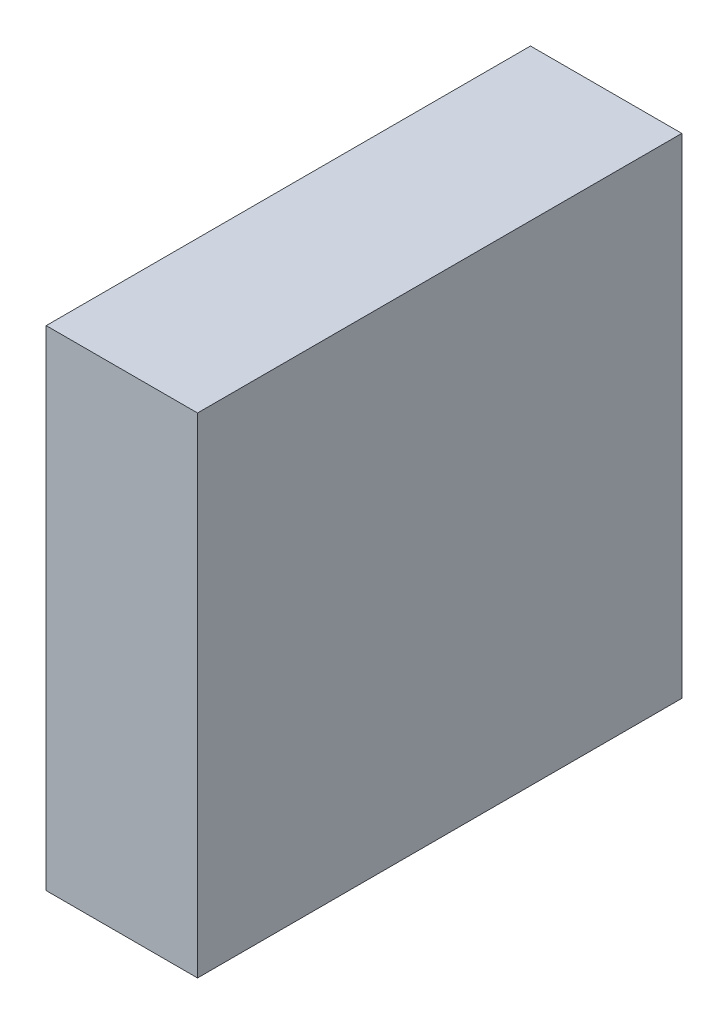
ISO-10303-21;
HEADER;
FILE_DESCRIPTION(('STEP AP214'),'2;1');
FILE_NAME('part.step','',(''),(''),'','','');
FILE_SCHEMA(('AUTOMOTIVE_DESIGN { 1 0 10303 214 1 1 1 1 }'));
ENDSEC;
DATA;
#1=APPLICATION_CONTEXT('core data for automotive mechanical design processes');
#2=APPLICATION_PROTOCOL_DEFINITION('international standard','automotive_design',2000,#1);
#3=PRODUCT_CONTEXT('',#1,'mechanical');
#4=PRODUCT('Part','Part','',(#3));
#5=PRODUCT_RELATED_PRODUCT_CATEGORY('part','',(#4));
#6=PRODUCT_DEFINITION_FORMATION('','',#4);
#7=PRODUCT_DEFINITION_CONTEXT('part definition',#1,'design');
#8=PRODUCT_DEFINITION('design','',#6,#7);
#9=PRODUCT_DEFINITION_SHAPE('','',#8);
#10=(LENGTH_UNIT() NAMED_UNIT(*) SI_UNIT(.MILLI.,.METRE.));
#11=(NAMED_UNIT(*) PLANE_ANGLE_UNIT() SI_UNIT($,.RADIAN.));
#12=(NAMED_UNIT(*) SI_UNIT($,.STERADIAN.) SOLID_ANGLE_UNIT());
#13=UNCERTAINTY_MEASURE_WITH_UNIT(LENGTH_MEASURE(1.E-05),#10,'distance_accuracy_value','');
#14=(GEOMETRIC_REPRESENTATION_CONTEXT(3) GLOBAL_UNCERTAINTY_ASSIGNED_CONTEXT((#13)) GLOBAL_UNIT_ASSIGNED_CONTEXT((#10,
#11,#12)) REPRESENTATION_CONTEXT('',''));
#15=CARTESIAN_POINT('',(0.,0.,0.));
#16=DIRECTION('',(0.,0.,1.));
#17=DIRECTION('',(1.,0.,0.));
#18=AXIS2_PLACEMENT_3D('',#15,#16,#17);
#19=CARTESIAN_POINT('',(30.,-48.5,-48.));
#20=DIRECTION('',(0.,0.,1.));
#21=DIRECTION('',(1.,0.,0.));
#22=AXIS2_PLACEMENT_3D('',#19,#20,#21);
#23=PLANE('',#22);
#24=DIRECTION('',(0.,1.,0.));
#25=VECTOR('',#24,1.);
#26=CARTESIAN_POINT('',(0.,-48.5,-48.));
#27=LINE('',#26,#25);
#28=CARTESIAN_POINT('',(0.,-48.5,-48.));
#29=VERTEX_POINT('',#28);
#30=CARTESIAN_POINT('',(0.,48.5,-48.));
#31=VERTEX_POINT('',#30);
#32=EDGE_CURVE('E95',#29,#31,#27,.T.);
#33=ORIENTED_EDGE('',*,*,#32,.T.);
#34=DIRECTION('',(-1.,0.,0.));
#35=VECTOR('',#34,1.);
#36=CARTESIAN_POINT('',(30.,48.5,-48.));
#37=LINE('',#36,#35);
#38=CARTESIAN_POINT('',(30.,48.5,-48.));
#39=VERTEX_POINT('',#38);
#40=EDGE_CURVE('E11',#39,#31,#37,.T.);
#41=ORIENTED_EDGE('',*,*,#40,.F.);
#42=DIRECTION('',(0.,1.,0.));
#43=VECTOR('',#42,1.);
#44=CARTESIAN_POINT('',(30.,-48.5,-48.));
#45=LINE('',#44,#43);
#46=CARTESIAN_POINT('',(30.,-48.5,-48.));
#47=VERTEX_POINT('',#46);
#48=EDGE_CURVE('E83',#47,#39,#45,.T.);
#49=ORIENTED_EDGE('',*,*,#48,.F.);
#50=DIRECTION('',(-1.,0.,0.));
#51=VECTOR('',#50,1.);
#52=CARTESIAN_POINT('',(30.,-48.5,-48.));
#53=LINE('',#52,#51);
#54=EDGE_CURVE('E91',#47,#29,#53,.T.);
#55=ORIENTED_EDGE('',*,*,#54,.T.);
#56=EDGE_LOOP('',(#33,#41,#49,#55));
#57=FACE_BOUND('',#56,.T.);
#58=ADVANCED_FACE('F32',(#57),#23,.F.);
#59=CARTESIAN_POINT('',(30.,48.5,48.));
#60=DIRECTION('',(0.,-1.,0.));
#61=DIRECTION('',(0.,0.,-1.));
#62=AXIS2_PLACEMENT_3D('',#59,#60,#61);
#63=PLANE('',#62);
#64=DIRECTION('',(0.,0.,1.));
#65=VECTOR('',#64,1.);
#66=CARTESIAN_POINT('',(0.,48.5,48.));
#67=LINE('',#66,#65);
#68=CARTESIAN_POINT('',(0.,48.5,48.));
#69=VERTEX_POINT('',#68);
#70=EDGE_CURVE('E87',#31,#69,#67,.T.);
#71=ORIENTED_EDGE('',*,*,#70,.T.);
#72=DIRECTION('',(-1.,0.,0.));
#73=VECTOR('',#72,1.);
#74=CARTESIAN_POINT('',(30.,48.5,48.));
#75=LINE('',#74,#73);
#76=CARTESIAN_POINT('',(30.,48.5,48.));
#77=VERTEX_POINT('',#76);
#78=EDGE_CURVE('E40',#77,#69,#75,.T.);
#79=ORIENTED_EDGE('',*,*,#78,.F.);
#80=DIRECTION('',(0.,0.,1.));
#81=VECTOR('',#80,1.);
#82=CARTESIAN_POINT('',(30.,48.5,48.));
#83=LINE('',#82,#81);
#84=EDGE_CURVE('E78',#39,#77,#83,.T.);
#85=ORIENTED_EDGE('',*,*,#84,.F.);
#86=ORIENTED_EDGE('',*,*,#40,.T.);
#87=EDGE_LOOP('',(#71,#79,#85,#86));
#88=FACE_BOUND('',#87,.T.);
#89=ADVANCED_FACE('F86',(#88),#63,.F.);
#90=CARTESIAN_POINT('',(30.,-48.5,48.));
#91=DIRECTION('',(0.,0.,-1.));
#92=DIRECTION('',(-1.,0.,0.));
#93=AXIS2_PLACEMENT_3D('',#90,#91,#92);
#94=PLANE('',#93);
#95=DIRECTION('',(0.,-1.,0.));
#96=VECTOR('',#95,1.);
#97=CARTESIAN_POINT('',(0.,-48.5,48.));
#98=LINE('',#97,#96);
#99=CARTESIAN_POINT('',(0.,-48.5,48.));
#100=VERTEX_POINT('',#99);
#101=EDGE_CURVE('E65',#69,#100,#98,.T.);
#102=ORIENTED_EDGE('',*,*,#101,.T.);
#103=DIRECTION('',(-1.,0.,0.));
#104=VECTOR('',#103,1.);
#105=CARTESIAN_POINT('',(30.,-48.5,48.));
#106=LINE('',#105,#104);
#107=CARTESIAN_POINT('',(30.,-48.5,48.));
#108=VERTEX_POINT('',#107);
#109=EDGE_CURVE('E88',#108,#100,#106,.T.);
#110=ORIENTED_EDGE('',*,*,#109,.F.);
#111=DIRECTION('',(0.,-1.,0.));
#112=VECTOR('',#111,1.);
#113=CARTESIAN_POINT('',(30.,-48.5,48.));
#114=LINE('',#113,#112);
#115=EDGE_CURVE('E81',#77,#108,#114,.T.);
#116=ORIENTED_EDGE('',*,*,#115,.F.);
#117=ORIENTED_EDGE('',*,*,#78,.T.);
#118=EDGE_LOOP('',(#102,#110,#116,#117));
#119=FACE_BOUND('',#118,.T.);
#120=ADVANCED_FACE('F89',(#119),#94,.F.);
#121=CARTESIAN_POINT('',(30.,-48.5,48.));
#122=DIRECTION('',(0.,1.,0.));
#123=DIRECTION('',(0.,0.,1.));
#124=AXIS2_PLACEMENT_3D('',#121,#122,#123);
#125=PLANE('',#124);
#126=DIRECTION('',(0.,0.,-1.));
#127=VECTOR('',#126,1.);
#128=CARTESIAN_POINT('',(0.,-48.5,48.));
#129=LINE('',#128,#127);
#130=EDGE_CURVE('E71',#100,#29,#129,.T.);
#131=ORIENTED_EDGE('',*,*,#130,.T.);
#132=ORIENTED_EDGE('',*,*,#54,.F.);
#133=DIRECTION('',(0.,0.,-1.));
#134=VECTOR('',#133,1.);
#135=CARTESIAN_POINT('',(30.,-48.5,48.));
#136=LINE('',#135,#134);
#137=EDGE_CURVE('E48',#108,#47,#136,.T.);
#138=ORIENTED_EDGE('',*,*,#137,.F.);
#139=ORIENTED_EDGE('',*,*,#109,.T.);
#140=EDGE_LOOP('',(#131,#132,#138,#139));
#141=FACE_BOUND('',#140,.T.);
#142=ADVANCED_FACE('F102',(#141),#125,.F.);
#143=CARTESIAN_POINT('',(30.,0.,0.));
#144=DIRECTION('',(-1.,0.,0.));
#145=DIRECTION('',(0.,0.,1.));
#146=AXIS2_PLACEMENT_3D('',#143,#144,#145);
#147=PLANE('',#146);
#148=ORIENTED_EDGE('',*,*,#48,.T.);
#149=ORIENTED_EDGE('',*,*,#84,.T.);
#150=ORIENTED_EDGE('',*,*,#115,.T.);
#151=ORIENTED_EDGE('',*,*,#137,.T.);
#152=EDGE_LOOP('',(#148,#149,#150,#151));
#153=FACE_BOUND('',#152,.T.);
#154=ADVANCED_FACE('F79',(#153),#147,.F.);
#155=CARTESIAN_POINT('',(0.,0.,0.));
#156=DIRECTION('',(-1.,0.,0.));
#157=DIRECTION('',(0.,0.,1.));
#158=AXIS2_PLACEMENT_3D('',#155,#156,#157);
#159=PLANE('',#158);
#160=ORIENTED_EDGE('',*,*,#32,.F.);
#161=ORIENTED_EDGE('',*,*,#130,.F.);
#162=ORIENTED_EDGE('',*,*,#101,.F.);
#163=ORIENTED_EDGE('',*,*,#70,.F.);
#164=EDGE_LOOP('',(#160,#161,#162,#163));
#165=FACE_BOUND('',#164,.T.);
#166=ADVANCED_FACE('F105',(#165),#159,.T.);
#167=CLOSED_SHELL('',(#58,#89,#120,#142,#154,#166));
#168=MANIFOLD_SOLID_BREP('B2',#167);
#169=ADVANCED_BREP_SHAPE_REPRESENTATION('',(#18,#168),#14);
#170=SHAPE_DEFINITION_REPRESENTATION(#9,#169);
ENDSEC;
END-ISO-10303-21;
